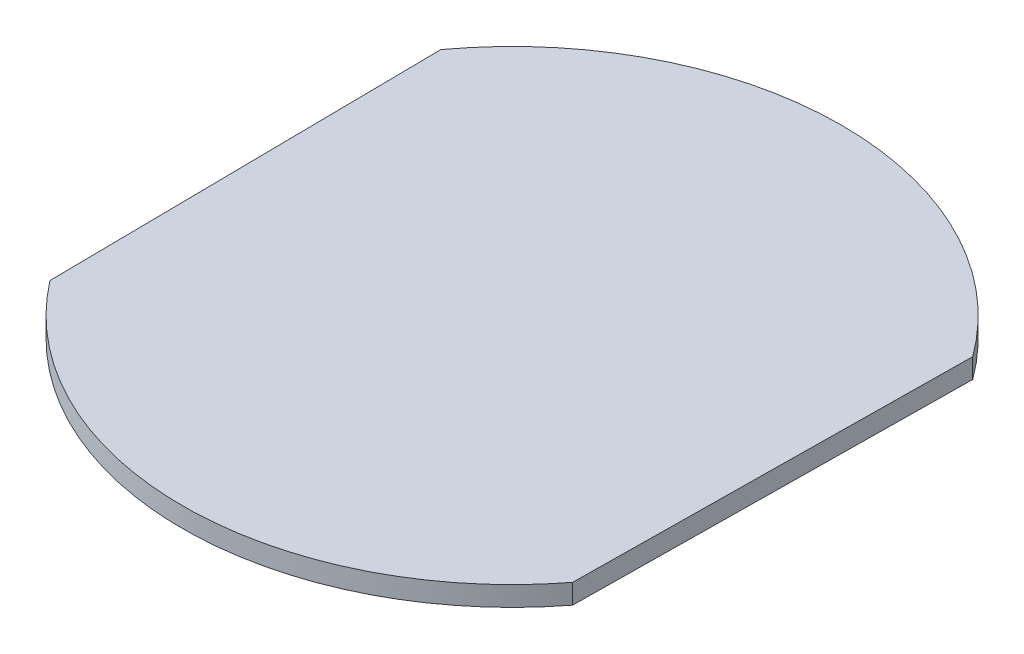
ISO-10303-21;
HEADER;
FILE_DESCRIPTION(('STEP AP214'),'2;1');
FILE_NAME('part.step','',(''),(''),'','','');
FILE_SCHEMA(('AUTOMOTIVE_DESIGN { 1 0 10303 214 1 1 1 1 }'));
ENDSEC;
DATA;
#1=APPLICATION_CONTEXT('core data for automotive mechanical design processes');
#2=APPLICATION_PROTOCOL_DEFINITION('international standard','automotive_design',2000,#1);
#3=PRODUCT_CONTEXT('',#1,'mechanical');
#4=PRODUCT('Part','Part','',(#3));
#5=PRODUCT_RELATED_PRODUCT_CATEGORY('part','',(#4));
#6=PRODUCT_DEFINITION_FORMATION('','',#4);
#7=PRODUCT_DEFINITION_CONTEXT('part definition',#1,'design');
#8=PRODUCT_DEFINITION('design','',#6,#7);
#9=PRODUCT_DEFINITION_SHAPE('','',#8);
#10=(LENGTH_UNIT() NAMED_UNIT(*) SI_UNIT(.MILLI.,.METRE.));
#11=(NAMED_UNIT(*) PLANE_ANGLE_UNIT() SI_UNIT($,.RADIAN.));
#12=(NAMED_UNIT(*) SI_UNIT($,.STERADIAN.) SOLID_ANGLE_UNIT());
#13=UNCERTAINTY_MEASURE_WITH_UNIT(LENGTH_MEASURE(1.E-05),#10,'distance_accuracy_value','');
#14=(GEOMETRIC_REPRESENTATION_CONTEXT(3) GLOBAL_UNCERTAINTY_ASSIGNED_CONTEXT((#13)) GLOBAL_UNIT_ASSIGNED_CONTEXT((#10,
#11,#12)) REPRESENTATION_CONTEXT('',''));
#15=CARTESIAN_POINT('',(0.,0.,0.));
#16=DIRECTION('',(0.,0.,1.));
#17=DIRECTION('',(1.,0.,0.));
#18=AXIS2_PLACEMENT_3D('',#15,#16,#17);
#19=CARTESIAN_POINT('',(0.,1.5,0.));
#20=DIRECTION('',(0.,-1.,0.));
#21=DIRECTION('',(0.,0.,-1.));
#22=AXIS2_PLACEMENT_3D('',#19,#20,#21);
#23=CYLINDRICAL_SURFACE('',#22,50.);
#24=CARTESIAN_POINT('',(0.,-1.5,0.));
#25=DIRECTION('',(0.,1.,0.));
#26=DIRECTION('',(0.,0.,1.));
#27=AXIS2_PLACEMENT_3D('',#24,#25,#26);
#28=CIRCLE('',#27,50.);
#29=CARTESIAN_POINT('',(-39.6484941518828,-1.5,30.4630417307287));
#30=VERTEX_POINT('',#29);
#31=CARTESIAN_POINT('',(39.6484941518828,-1.5,30.4630417307287));
#32=VERTEX_POINT('',#31);
#33=EDGE_CURVE('E96',#30,#32,#28,.T.);
#34=ORIENTED_EDGE('',*,*,#33,.T.);
#35=DIRECTION('',(0.,-1.,0.));
#36=VECTOR('',#35,1.);
#37=CARTESIAN_POINT('',(39.6484941518828,1.5,30.4630417307287));
#38=LINE('',#37,#36);
#39=CARTESIAN_POINT('',(39.6484941518828,1.5,30.4630417307287));
#40=VERTEX_POINT('',#39);
#41=EDGE_CURVE('E11',#40,#32,#38,.T.);
#42=ORIENTED_EDGE('',*,*,#41,.F.);
#43=CARTESIAN_POINT('',(0.,1.5,0.));
#44=DIRECTION('',(0.,1.,0.));
#45=DIRECTION('',(0.,0.,1.));
#46=AXIS2_PLACEMENT_3D('',#43,#44,#45);
#47=CIRCLE('',#46,50.);
#48=CARTESIAN_POINT('',(-39.6484941518828,1.5,30.4630417307287));
#49=VERTEX_POINT('',#48);
#50=EDGE_CURVE('E84',#49,#40,#47,.T.);
#51=ORIENTED_EDGE('',*,*,#50,.F.);
#52=DIRECTION('',(0.,-1.,0.));
#53=VECTOR('',#52,1.);
#54=CARTESIAN_POINT('',(-39.6484941518828,1.5,30.4630417307287));
#55=LINE('',#54,#53);
#56=EDGE_CURVE('E92',#49,#30,#55,.T.);
#57=ORIENTED_EDGE('',*,*,#56,.T.);
#58=EDGE_LOOP('',(#34,#42,#51,#57));
#59=FACE_BOUND('',#58,.T.);
#60=ADVANCED_FACE('F33',(#59),#23,.T.);
#61=CARTESIAN_POINT('',(39.6484941518828,1.5,30.4630417307287));
#62=DIRECTION('',(-0.999932407198869,0.,-0.0116267378690649));
#63=DIRECTION('',(-0.0116267378690649,0.,0.999932407198869));
#64=AXIS2_PLACEMENT_3D('',#61,#62,#63);
#65=PLANE('',#64);
#66=DIRECTION('',(0.0116267378690649,0.,-0.999932407198869));
#67=VECTOR('',#66,1.);
#68=CARTESIAN_POINT('',(39.6484941518828,-1.5,30.4630417307287));
#69=LINE('',#68,#67);
#70=CARTESIAN_POINT('',(40.3460984240267,-1.5,-29.5329027012035));
#71=VERTEX_POINT('',#70);
#72=EDGE_CURVE('E88',#32,#71,#69,.T.);
#73=ORIENTED_EDGE('',*,*,#72,.T.);
#74=DIRECTION('',(0.,-1.,0.));
#75=VECTOR('',#74,1.);
#76=CARTESIAN_POINT('',(40.3460984240267,1.5,-29.5329027012035));
#77=LINE('',#76,#75);
#78=CARTESIAN_POINT('',(40.3460984240267,1.5,-29.5329027012035));
#79=VERTEX_POINT('',#78);
#80=EDGE_CURVE('E41',#79,#71,#77,.T.);
#81=ORIENTED_EDGE('',*,*,#80,.F.);
#82=DIRECTION('',(0.0116267378690649,0.,-0.999932407198869));
#83=VECTOR('',#82,1.);
#84=CARTESIAN_POINT('',(39.6484941518828,1.5,30.4630417307287));
#85=LINE('',#84,#83);
#86=EDGE_CURVE('E79',#40,#79,#85,.T.);
#87=ORIENTED_EDGE('',*,*,#86,.F.);
#88=ORIENTED_EDGE('',*,*,#41,.T.);
#89=EDGE_LOOP('',(#73,#81,#87,#88));
#90=FACE_BOUND('',#89,.T.);
#91=ADVANCED_FACE('F87',(#90),#65,.F.);
#92=CARTESIAN_POINT('',(0.,1.5,0.));
#93=DIRECTION('',(0.,-1.,0.));
#94=DIRECTION('',(0.,0.,-1.));
#95=AXIS2_PLACEMENT_3D('',#92,#93,#94);
#96=CYLINDRICAL_SURFACE('',#95,50.);
#97=CARTESIAN_POINT('',(0.,-1.5,0.));
#98=DIRECTION('',(0.,1.,0.));
#99=DIRECTION('',(0.,0.,1.));
#100=AXIS2_PLACEMENT_3D('',#97,#98,#99);
#101=CIRCLE('',#100,50.);
#102=CARTESIAN_POINT('',(-40.3460984240267,-1.5,-29.5329027012035));
#103=VERTEX_POINT('',#102);
#104=EDGE_CURVE('E66',#71,#103,#101,.T.);
#105=ORIENTED_EDGE('',*,*,#104,.T.);
#106=DIRECTION('',(0.,-1.,0.));
#107=VECTOR('',#106,1.);
#108=CARTESIAN_POINT('',(-40.3460984240267,1.5,-29.5329027012035));
#109=LINE('',#108,#107);
#110=CARTESIAN_POINT('',(-40.3460984240267,1.5,-29.5329027012035));
#111=VERTEX_POINT('',#110);
#112=EDGE_CURVE('E89',#111,#103,#109,.T.);
#113=ORIENTED_EDGE('',*,*,#112,.F.);
#114=CARTESIAN_POINT('',(0.,1.5,0.));
#115=DIRECTION('',(0.,1.,0.));
#116=DIRECTION('',(0.,0.,1.));
#117=AXIS2_PLACEMENT_3D('',#114,#115,#116);
#118=CIRCLE('',#117,50.);
#119=EDGE_CURVE('E82',#79,#111,#118,.T.);
#120=ORIENTED_EDGE('',*,*,#119,.F.);
#121=ORIENTED_EDGE('',*,*,#80,.T.);
#122=EDGE_LOOP('',(#105,#113,#120,#121));
#123=FACE_BOUND('',#122,.T.);
#124=ADVANCED_FACE('F90',(#123),#96,.T.);
#125=CARTESIAN_POINT('',(-39.6484941518828,1.5,30.4630417307287));
#126=DIRECTION('',(0.999932407198869,0.,-0.0116267378690649));
#127=DIRECTION('',(-0.0116267378690649,0.,-0.999932407198869));
#128=AXIS2_PLACEMENT_3D('',#125,#126,#127);
#129=PLANE('',#128);
#130=DIRECTION('',(0.0116267378690649,0.,0.999932407198869));
#131=VECTOR('',#130,1.);
#132=CARTESIAN_POINT('',(-39.6484941518828,-1.5,30.4630417307287));
#133=LINE('',#132,#131);
#134=EDGE_CURVE('E72',#103,#30,#133,.T.);
#135=ORIENTED_EDGE('',*,*,#134,.T.);
#136=ORIENTED_EDGE('',*,*,#56,.F.);
#137=DIRECTION('',(0.0116267378690649,0.,0.999932407198869));
#138=VECTOR('',#137,1.);
#139=CARTESIAN_POINT('',(-39.6484941518828,1.5,30.4630417307287));
#140=LINE('',#139,#138);
#141=EDGE_CURVE('E49',#111,#49,#140,.T.);
#142=ORIENTED_EDGE('',*,*,#141,.F.);
#143=ORIENTED_EDGE('',*,*,#112,.T.);
#144=EDGE_LOOP('',(#135,#136,#142,#143));
#145=FACE_BOUND('',#144,.T.);
#146=ADVANCED_FACE('F103',(#145),#129,.F.);
#147=CARTESIAN_POINT('',(0.,1.5,0.));
#148=DIRECTION('',(0.,1.,0.));
#149=DIRECTION('',(0.,0.,1.));
#150=AXIS2_PLACEMENT_3D('',#147,#148,#149);
#151=PLANE('',#150);
#152=ORIENTED_EDGE('',*,*,#50,.T.);
#153=ORIENTED_EDGE('',*,*,#86,.T.);
#154=ORIENTED_EDGE('',*,*,#119,.T.);
#155=ORIENTED_EDGE('',*,*,#141,.T.);
#156=EDGE_LOOP('',(#152,#153,#154,#155));
#157=FACE_BOUND('',#156,.T.);
#158=ADVANCED_FACE('F80',(#157),#151,.T.);
#159=CARTESIAN_POINT('',(0.,-1.5,0.));
#160=DIRECTION('',(0.,1.,0.));
#161=DIRECTION('',(0.,0.,1.));
#162=AXIS2_PLACEMENT_3D('',#159,#160,#161);
#163=PLANE('',#162);
#164=ORIENTED_EDGE('',*,*,#33,.F.);
#165=ORIENTED_EDGE('',*,*,#134,.F.);
#166=ORIENTED_EDGE('',*,*,#104,.F.);
#167=ORIENTED_EDGE('',*,*,#72,.F.);
#168=EDGE_LOOP('',(#164,#165,#166,#167));
#169=FACE_BOUND('',#168,.T.);
#170=ADVANCED_FACE('F106',(#169),#163,.F.);
#171=CLOSED_SHELL('',(#60,#91,#124,#146,#158,#170));
#172=MANIFOLD_SOLID_BREP('B2',#171);
#173=ADVANCED_BREP_SHAPE_REPRESENTATION('',(#18,#172),#14);
#174=SHAPE_DEFINITION_REPRESENTATION(#9,#173);
ENDSEC;
END-ISO-10303-21;
